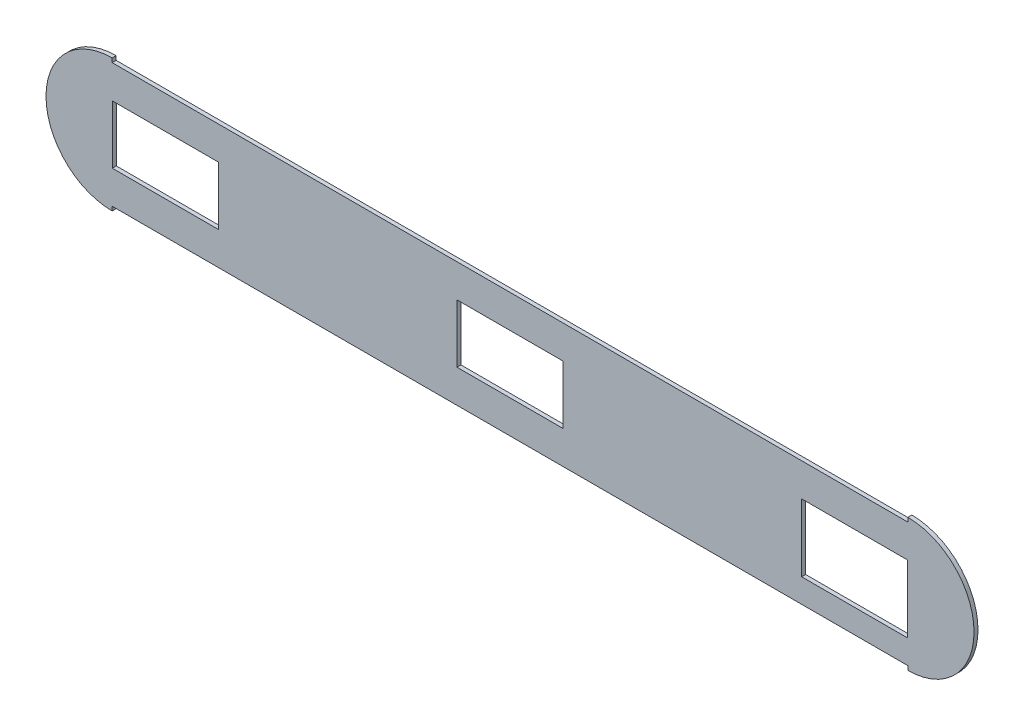
ISO-10303-21;
HEADER;
FILE_DESCRIPTION(('STEP AP214'),'2;1');
FILE_NAME('part.step','',(''),(''),'','','');
FILE_SCHEMA(('AUTOMOTIVE_DESIGN { 1 0 10303 214 1 1 1 1 }'));
ENDSEC;
DATA;
#1=APPLICATION_CONTEXT('core data for automotive mechanical design processes');
#2=APPLICATION_PROTOCOL_DEFINITION('international standard','automotive_design',2000,#1);
#3=PRODUCT_CONTEXT('',#1,'mechanical');
#4=PRODUCT('Part','Part','',(#3));
#5=PRODUCT_RELATED_PRODUCT_CATEGORY('part','',(#4));
#6=PRODUCT_DEFINITION_FORMATION('','',#4);
#7=PRODUCT_DEFINITION_CONTEXT('part definition',#1,'design');
#8=PRODUCT_DEFINITION('design','',#6,#7);
#9=PRODUCT_DEFINITION_SHAPE('','',#8);
#10=(LENGTH_UNIT() NAMED_UNIT(*) SI_UNIT(.MILLI.,.METRE.));
#11=(NAMED_UNIT(*) PLANE_ANGLE_UNIT() SI_UNIT($,.RADIAN.));
#12=(NAMED_UNIT(*) SI_UNIT($,.STERADIAN.) SOLID_ANGLE_UNIT());
#13=UNCERTAINTY_MEASURE_WITH_UNIT(LENGTH_MEASURE(1.E-05),#10,'distance_accuracy_value','');
#14=(GEOMETRIC_REPRESENTATION_CONTEXT(3) GLOBAL_UNCERTAINTY_ASSIGNED_CONTEXT((#13)) GLOBAL_UNIT_ASSIGNED_CONTEXT((#10,
#11,#12)) REPRESENTATION_CONTEXT('',''));
#15=CARTESIAN_POINT('',(0.,0.,0.));
#16=DIRECTION('',(0.,0.,1.));
#17=DIRECTION('',(1.,0.,0.));
#18=AXIS2_PLACEMENT_3D('',#15,#16,#17);
#19=CARTESIAN_POINT('',(-300.,0.,0.));
#20=DIRECTION('',(0.,0.,1.));
#21=DIRECTION('',(1.,0.,0.));
#22=AXIS2_PLACEMENT_3D('',#19,#20,#21);
#23=PLANE('',#22);
#24=DIRECTION('',(1.,0.,0.));
#25=VECTOR('',#24,1.);
#26=CARTESIAN_POINT('',(-300.,-28.9008568911611,0.));
#27=LINE('',#26,#25);
#28=CARTESIAN_POINT('',(220.,-28.900856891161,0.));
#29=VERTEX_POINT('',#28);
#30=CARTESIAN_POINT('',(300.,-28.900856891161,0.));
#31=VERTEX_POINT('',#30);
#32=EDGE_CURVE('E269',#29,#31,#27,.T.);
#33=ORIENTED_EDGE('',*,*,#32,.T.);
#34=DIRECTION('',(0.,1.,0.));
#35=VECTOR('',#34,1.);
#36=CARTESIAN_POINT('',(300.,0.,0.));
#37=LINE('',#36,#35);
#38=CARTESIAN_POINT('',(300.,22.,0.));
#39=VERTEX_POINT('',#38);
#40=EDGE_CURVE('E278',#31,#39,#37,.T.);
#41=ORIENTED_EDGE('',*,*,#40,.T.);
#42=DIRECTION('',(-1.,0.,0.));
#43=VECTOR('',#42,1.);
#44=CARTESIAN_POINT('',(-300.,22.,0.));
#45=LINE('',#44,#43);
#46=CARTESIAN_POINT('',(220.,22.,0.));
#47=VERTEX_POINT('',#46);
#48=EDGE_CURVE('E275',#39,#47,#45,.T.);
#49=ORIENTED_EDGE('',*,*,#48,.T.);
#50=DIRECTION('',(0.,-1.,0.));
#51=VECTOR('',#50,1.);
#52=CARTESIAN_POINT('',(220.,0.,0.));
#53=LINE('',#52,#51);
#54=EDGE_CURVE('E272',#47,#29,#53,.T.);
#55=ORIENTED_EDGE('',*,*,#54,.T.);
#56=EDGE_LOOP('',(#33,#41,#49,#55));
#57=FACE_BOUND('',#56,.T.);
#58=DIRECTION('',(-1.,0.,0.));
#59=VECTOR('',#58,1.);
#60=CARTESIAN_POINT('',(-300.,22.,0.));
#61=LINE('',#60,#59);
#62=CARTESIAN_POINT('',(-220.,22.,0.));
#63=VERTEX_POINT('',#62);
#64=CARTESIAN_POINT('',(-300.,22.,0.));
#65=VERTEX_POINT('',#64);
#66=EDGE_CURVE('E257',#63,#65,#61,.T.);
#67=ORIENTED_EDGE('',*,*,#66,.T.);
#68=DIRECTION('',(0.,-1.,0.));
#69=VECTOR('',#68,1.);
#70=CARTESIAN_POINT('',(-300.,0.,0.));
#71=LINE('',#70,#69);
#72=CARTESIAN_POINT('',(-300.,-22.,0.));
#73=VERTEX_POINT('',#72);
#74=EDGE_CURVE('E266',#65,#73,#71,.T.);
#75=ORIENTED_EDGE('',*,*,#74,.T.);
#76=DIRECTION('',(1.,0.,0.));
#77=VECTOR('',#76,1.);
#78=CARTESIAN_POINT('',(-300.,-22.,0.));
#79=LINE('',#78,#77);
#80=CARTESIAN_POINT('',(-220.,-22.0000000000001,0.));
#81=VERTEX_POINT('',#80);
#82=EDGE_CURVE('E263',#73,#81,#79,.T.);
#83=ORIENTED_EDGE('',*,*,#82,.T.);
#84=DIRECTION('',(0.,1.,0.));
#85=VECTOR('',#84,1.);
#86=CARTESIAN_POINT('',(-220.,0.,0.));
#87=LINE('',#86,#85);
#88=EDGE_CURVE('E260',#81,#63,#87,.T.);
#89=ORIENTED_EDGE('',*,*,#88,.T.);
#90=EDGE_LOOP('',(#67,#75,#83,#89));
#91=FACE_BOUND('',#90,.T.);
#92=DIRECTION('',(1.,0.,0.));
#93=VECTOR('',#92,1.);
#94=CARTESIAN_POINT('',(-300.,-22.,0.));
#95=LINE('',#94,#93);
#96=CARTESIAN_POINT('',(-40.0000000000001,-22.,0.));
#97=VERTEX_POINT('',#96);
#98=CARTESIAN_POINT('',(39.9999999999999,-22.,0.));
#99=VERTEX_POINT('',#98);
#100=EDGE_CURVE('E216',#97,#99,#95,.T.);
#101=ORIENTED_EDGE('',*,*,#100,.T.);
#102=DIRECTION('',(0.,1.,0.));
#103=VECTOR('',#102,1.);
#104=CARTESIAN_POINT('',(39.9999999999999,0.,0.));
#105=LINE('',#104,#103);
#106=CARTESIAN_POINT('',(39.9999999999999,22.,0.));
#107=VERTEX_POINT('',#106);
#108=EDGE_CURVE('E254',#99,#107,#105,.T.);
#109=ORIENTED_EDGE('',*,*,#108,.T.);
#110=DIRECTION('',(-1.,0.,0.));
#111=VECTOR('',#110,1.);
#112=CARTESIAN_POINT('',(-300.,22.,0.));
#113=LINE('',#112,#111);
#114=CARTESIAN_POINT('',(-40.0000000000001,22.,0.));
#115=VERTEX_POINT('',#114);
#116=EDGE_CURVE('E251',#107,#115,#113,.T.);
#117=ORIENTED_EDGE('',*,*,#116,.T.);
#118=DIRECTION('',(0.,-1.,0.));
#119=VECTOR('',#118,1.);
#120=CARTESIAN_POINT('',(-40.0000000000001,0.,0.));
#121=LINE('',#120,#119);
#122=EDGE_CURVE('E248',#115,#97,#121,.T.);
#123=ORIENTED_EDGE('',*,*,#122,.T.);
#124=EDGE_LOOP('',(#101,#109,#117,#123));
#125=FACE_BOUND('',#124,.T.);
#126=CARTESIAN_POINT('',(300.,0.,0.));
#127=DIRECTION('',(0.,0.,1.));
#128=DIRECTION('',(1.,0.,0.));
#129=AXIS2_PLACEMENT_3D('',#126,#127,#128);
#130=CIRCLE('',#129,50.);
#131=CARTESIAN_POINT('',(300.1,-49.9998999999,0.));
#132=VERTEX_POINT('',#131);
#133=CARTESIAN_POINT('',(300.1,49.9998999999,0.));
#134=VERTEX_POINT('',#133);
#135=EDGE_CURVE('E186',#132,#134,#130,.T.);
#136=ORIENTED_EDGE('',*,*,#135,.F.);
#137=DIRECTION('',(0.,-1.,0.));
#138=VECTOR('',#137,1.);
#139=CARTESIAN_POINT('',(300.1,-50.1,0.));
#140=LINE('',#139,#138);
#141=CARTESIAN_POINT('',(300.1,-46.9,0.));
#142=VERTEX_POINT('',#141);
#143=EDGE_CURVE('E46',#142,#132,#140,.T.);
#144=ORIENTED_EDGE('',*,*,#143,.F.);
#145=DIRECTION('',(1.,0.,0.));
#146=VECTOR('',#145,1.);
#147=CARTESIAN_POINT('',(300.1,-46.9,0.));
#148=LINE('',#147,#146);
#149=CARTESIAN_POINT('',(-300.1,-46.9,0.));
#150=VERTEX_POINT('',#149);
#151=EDGE_CURVE('E176',#150,#142,#148,.T.);
#152=ORIENTED_EDGE('',*,*,#151,.F.);
#153=DIRECTION('',(0.,1.,0.));
#154=VECTOR('',#153,1.);
#155=CARTESIAN_POINT('',(-300.1,-50.1,0.));
#156=LINE('',#155,#154);
#157=CARTESIAN_POINT('',(-300.1,-49.9998999999,0.));
#158=VERTEX_POINT('',#157);
#159=EDGE_CURVE('E182',#158,#150,#156,.T.);
#160=ORIENTED_EDGE('',*,*,#159,.F.);
#161=CARTESIAN_POINT('',(-300.,0.,0.));
#162=DIRECTION('',(0.,0.,1.));
#163=DIRECTION('',(1.,0.,0.));
#164=AXIS2_PLACEMENT_3D('',#161,#162,#163);
#165=CIRCLE('',#164,50.);
#166=CARTESIAN_POINT('',(-300.1,49.9998999999,0.));
#167=VERTEX_POINT('',#166);
#168=EDGE_CURVE('E284',#167,#158,#165,.T.);
#169=ORIENTED_EDGE('',*,*,#168,.F.);
#170=DIRECTION('',(0.,-1.,0.));
#171=VECTOR('',#170,1.);
#172=CARTESIAN_POINT('',(-300.1,50.1,0.));
#173=LINE('',#172,#171);
#174=CARTESIAN_POINT('',(-300.1,46.9,0.));
#175=VERTEX_POINT('',#174);
#176=EDGE_CURVE('E194',#167,#175,#173,.T.);
#177=ORIENTED_EDGE('',*,*,#176,.T.);
#178=DIRECTION('',(1.,0.,0.));
#179=VECTOR('',#178,1.);
#180=CARTESIAN_POINT('',(-300.1,46.9,0.));
#181=LINE('',#180,#179);
#182=CARTESIAN_POINT('',(300.1,46.9,0.));
#183=VERTEX_POINT('',#182);
#184=EDGE_CURVE('E197',#175,#183,#181,.T.);
#185=ORIENTED_EDGE('',*,*,#184,.T.);
#186=DIRECTION('',(0.,1.,0.));
#187=VECTOR('',#186,1.);
#188=CARTESIAN_POINT('',(300.1,50.1,0.));
#189=LINE('',#188,#187);
#190=EDGE_CURVE('E200',#183,#134,#189,.T.);
#191=ORIENTED_EDGE('',*,*,#190,.T.);
#192=EDGE_LOOP('',(#136,#144,#152,#160,#169,#177,#185,#191));
#193=FACE_BOUND('',#192,.T.);
#194=ADVANCED_FACE('F32',(#57,#91,#125,#193),#23,.F.);
#195=CARTESIAN_POINT('',(-300.,0.,3.));
#196=DIRECTION('',(0.,0.,1.));
#197=DIRECTION('',(1.,0.,0.));
#198=AXIS2_PLACEMENT_3D('',#195,#196,#197);
#199=PLANE('',#198);
#200=DIRECTION('',(0.,1.,0.));
#201=VECTOR('',#200,1.);
#202=CARTESIAN_POINT('',(300.1,0.,3.));
#203=LINE('',#202,#201);
#204=CARTESIAN_POINT('',(300.1,-49.9998999999,3.));
#205=VERTEX_POINT('',#204);
#206=CARTESIAN_POINT('',(300.1,-46.9,3.));
#207=VERTEX_POINT('',#206);
#208=EDGE_CURVE('E170',#205,#207,#203,.T.);
#209=ORIENTED_EDGE('',*,*,#208,.F.);
#210=CARTESIAN_POINT('',(300.,0.,3.));
#211=DIRECTION('',(0.,0.,1.));
#212=DIRECTION('',(1.,0.,0.));
#213=AXIS2_PLACEMENT_3D('',#210,#211,#212);
#214=CIRCLE('',#213,50.);
#215=CARTESIAN_POINT('',(300.1,49.9998999999,3.));
#216=VERTEX_POINT('',#215);
#217=EDGE_CURVE('E54',#205,#216,#214,.T.);
#218=ORIENTED_EDGE('',*,*,#217,.T.);
#219=DIRECTION('',(0.,1.,0.));
#220=VECTOR('',#219,1.);
#221=CARTESIAN_POINT('',(300.099999999999,-1.04100755793368E-11,3.));
#222=LINE('',#221,#220);
#223=CARTESIAN_POINT('',(300.1,46.9,3.));
#224=VERTEX_POINT('',#223);
#225=EDGE_CURVE('E206',#224,#216,#222,.T.);
#226=ORIENTED_EDGE('',*,*,#225,.F.);
#227=DIRECTION('',(1.,0.,0.));
#228=VECTOR('',#227,1.);
#229=CARTESIAN_POINT('',(-300.,46.9,3.));
#230=LINE('',#229,#228);
#231=CARTESIAN_POINT('',(-300.1,46.9,3.));
#232=VERTEX_POINT('',#231);
#233=EDGE_CURVE('E322',#232,#224,#230,.T.);
#234=ORIENTED_EDGE('',*,*,#233,.F.);
#235=DIRECTION('',(0.,-1.,0.));
#236=VECTOR('',#235,1.);
#237=CARTESIAN_POINT('',(-300.1,0.,3.));
#238=LINE('',#237,#236);
#239=CARTESIAN_POINT('',(-300.1,49.9998999999,3.));
#240=VERTEX_POINT('',#239);
#241=EDGE_CURVE('E210',#240,#232,#238,.T.);
#242=ORIENTED_EDGE('',*,*,#241,.F.);
#243=CARTESIAN_POINT('',(-300.,0.,3.));
#244=DIRECTION('',(0.,0.,1.));
#245=DIRECTION('',(1.,0.,0.));
#246=AXIS2_PLACEMENT_3D('',#243,#244,#245);
#247=CIRCLE('',#246,50.);
#248=CARTESIAN_POINT('',(-300.1,-49.9998999999,3.));
#249=VERTEX_POINT('',#248);
#250=EDGE_CURVE('E283',#240,#249,#247,.T.);
#251=ORIENTED_EDGE('',*,*,#250,.T.);
#252=DIRECTION('',(0.,-1.,0.));
#253=VECTOR('',#252,1.);
#254=CARTESIAN_POINT('',(-300.099999999999,0.,3.));
#255=LINE('',#254,#253);
#256=CARTESIAN_POINT('',(-300.1,-46.9,3.));
#257=VERTEX_POINT('',#256);
#258=EDGE_CURVE('E188',#257,#249,#255,.T.);
#259=ORIENTED_EDGE('',*,*,#258,.F.);
#260=DIRECTION('',(-1.,0.,0.));
#261=VECTOR('',#260,1.);
#262=CARTESIAN_POINT('',(-300.,-46.9,3.));
#263=LINE('',#262,#261);
#264=EDGE_CURVE('E11',#207,#257,#263,.T.);
#265=ORIENTED_EDGE('',*,*,#264,.F.);
#266=EDGE_LOOP('',(#209,#218,#226,#234,#242,#251,#259,#265));
#267=FACE_BOUND('',#266,.T.);
#268=DIRECTION('',(0.,1.,0.));
#269=VECTOR('',#268,1.);
#270=CARTESIAN_POINT('',(300.,0.,3.));
#271=LINE('',#270,#269);
#272=CARTESIAN_POINT('',(300.,-28.900856891161,3.));
#273=VERTEX_POINT('',#272);
#274=CARTESIAN_POINT('',(300.,22.,3.));
#275=VERTEX_POINT('',#274);
#276=EDGE_CURVE('E314',#273,#275,#271,.T.);
#277=ORIENTED_EDGE('',*,*,#276,.F.);
#278=DIRECTION('',(1.,0.,0.));
#279=VECTOR('',#278,1.);
#280=CARTESIAN_POINT('',(-300.,-28.9008568911611,3.));
#281=LINE('',#280,#279);
#282=CARTESIAN_POINT('',(220.,-28.900856891161,3.));
#283=VERTEX_POINT('',#282);
#284=EDGE_CURVE('E307',#283,#273,#281,.T.);
#285=ORIENTED_EDGE('',*,*,#284,.F.);
#286=DIRECTION('',(0.,-1.,0.));
#287=VECTOR('',#286,1.);
#288=CARTESIAN_POINT('',(220.,0.,3.));
#289=LINE('',#288,#287);
#290=CARTESIAN_POINT('',(220.,22.,3.));
#291=VERTEX_POINT('',#290);
#292=EDGE_CURVE('E309',#291,#283,#289,.T.);
#293=ORIENTED_EDGE('',*,*,#292,.F.);
#294=DIRECTION('',(-1.,0.,0.));
#295=VECTOR('',#294,1.);
#296=CARTESIAN_POINT('',(-300.,22.,3.));
#297=LINE('',#296,#295);
#298=EDGE_CURVE('E312',#275,#291,#297,.T.);
#299=ORIENTED_EDGE('',*,*,#298,.F.);
#300=EDGE_LOOP('',(#277,#285,#293,#299));
#301=FACE_BOUND('',#300,.T.);
#302=DIRECTION('',(0.,-1.,0.));
#303=VECTOR('',#302,1.);
#304=CARTESIAN_POINT('',(-300.,0.,3.));
#305=LINE('',#304,#303);
#306=CARTESIAN_POINT('',(-300.,22.,3.));
#307=VERTEX_POINT('',#306);
#308=CARTESIAN_POINT('',(-300.,-22.,3.));
#309=VERTEX_POINT('',#308);
#310=EDGE_CURVE('E305',#307,#309,#305,.T.);
#311=ORIENTED_EDGE('',*,*,#310,.F.);
#312=DIRECTION('',(-1.,0.,0.));
#313=VECTOR('',#312,1.);
#314=CARTESIAN_POINT('',(-300.,22.,3.));
#315=LINE('',#314,#313);
#316=CARTESIAN_POINT('',(-220.,22.,3.));
#317=VERTEX_POINT('',#316);
#318=EDGE_CURVE('E298',#317,#307,#315,.T.);
#319=ORIENTED_EDGE('',*,*,#318,.F.);
#320=DIRECTION('',(0.,1.,0.));
#321=VECTOR('',#320,1.);
#322=CARTESIAN_POINT('',(-220.,0.,3.));
#323=LINE('',#322,#321);
#324=CARTESIAN_POINT('',(-220.,-22.0000000000001,3.));
#325=VERTEX_POINT('',#324);
#326=EDGE_CURVE('E300',#325,#317,#323,.T.);
#327=ORIENTED_EDGE('',*,*,#326,.F.);
#328=DIRECTION('',(1.,0.,0.));
#329=VECTOR('',#328,1.);
#330=CARTESIAN_POINT('',(-300.,-22.,3.));
#331=LINE('',#330,#329);
#332=EDGE_CURVE('E303',#309,#325,#331,.T.);
#333=ORIENTED_EDGE('',*,*,#332,.F.);
#334=EDGE_LOOP('',(#311,#319,#327,#333));
#335=FACE_BOUND('',#334,.T.);
#336=DIRECTION('',(0.,1.,0.));
#337=VECTOR('',#336,1.);
#338=CARTESIAN_POINT('',(39.9999999999999,0.,3.));
#339=LINE('',#338,#337);
#340=CARTESIAN_POINT('',(39.9999999999999,-22.,3.));
#341=VERTEX_POINT('',#340);
#342=CARTESIAN_POINT('',(39.9999999999999,22.,3.));
#343=VERTEX_POINT('',#342);
#344=EDGE_CURVE('E296',#341,#343,#339,.T.);
#345=ORIENTED_EDGE('',*,*,#344,.F.);
#346=DIRECTION('',(1.,0.,0.));
#347=VECTOR('',#346,1.);
#348=CARTESIAN_POINT('',(-300.,-22.,3.));
#349=LINE('',#348,#347);
#350=CARTESIAN_POINT('',(-40.0000000000001,-22.,3.));
#351=VERTEX_POINT('',#350);
#352=EDGE_CURVE('E287',#351,#341,#349,.T.);
#353=ORIENTED_EDGE('',*,*,#352,.F.);
#354=DIRECTION('',(0.,-1.,0.));
#355=VECTOR('',#354,1.);
#356=CARTESIAN_POINT('',(-40.0000000000001,0.,3.));
#357=LINE('',#356,#355);
#358=CARTESIAN_POINT('',(-40.0000000000001,22.,3.));
#359=VERTEX_POINT('',#358);
#360=EDGE_CURVE('E291',#359,#351,#357,.T.);
#361=ORIENTED_EDGE('',*,*,#360,.F.);
#362=DIRECTION('',(-1.,0.,0.));
#363=VECTOR('',#362,1.);
#364=CARTESIAN_POINT('',(-300.,22.,3.));
#365=LINE('',#364,#363);
#366=EDGE_CURVE('E294',#343,#359,#365,.T.);
#367=ORIENTED_EDGE('',*,*,#366,.F.);
#368=EDGE_LOOP('',(#345,#353,#361,#367));
#369=FACE_BOUND('',#368,.T.);
#370=ADVANCED_FACE('F333',(#267,#301,#335,#369),#199,.T.);
#371=CARTESIAN_POINT('',(-300.,0.,60.));
#372=DIRECTION('',(0.,0.,-1.));
#373=DIRECTION('',(-1.,0.,0.));
#374=AXIS2_PLACEMENT_3D('',#371,#372,#373);
#375=CYLINDRICAL_SURFACE('',#374,50.);
#376=ORIENTED_EDGE('',*,*,#168,.T.);
#377=DIRECTION('',(0.,0.,-1.));
#378=VECTOR('',#377,1.);
#379=CARTESIAN_POINT('',(-300.1,-49.9998999999,60.));
#380=LINE('',#379,#378);
#381=EDGE_CURVE('E39',#158,#249,#380,.F.);
#382=ORIENTED_EDGE('',*,*,#381,.T.);
#383=ORIENTED_EDGE('',*,*,#250,.F.);
#384=DIRECTION('',(0.,0.,-1.));
#385=VECTOR('',#384,1.);
#386=CARTESIAN_POINT('',(-300.1,49.9998999999,60.));
#387=LINE('',#386,#385);
#388=EDGE_CURVE('E319',#240,#167,#387,.T.);
#389=ORIENTED_EDGE('',*,*,#388,.T.);
#390=EDGE_LOOP('',(#376,#382,#383,#389));
#391=FACE_BOUND('',#390,.T.);
#392=ADVANCED_FACE('F328',(#391),#375,.T.);
#393=CARTESIAN_POINT('',(300.,0.,60.));
#394=DIRECTION('',(0.,0.,-1.));
#395=DIRECTION('',(-1.,0.,0.));
#396=AXIS2_PLACEMENT_3D('',#393,#394,#395);
#397=CYLINDRICAL_SURFACE('',#396,50.);
#398=ORIENTED_EDGE('',*,*,#217,.F.);
#399=DIRECTION('',(0.,0.,-1.));
#400=VECTOR('',#399,1.);
#401=CARTESIAN_POINT('',(300.1,-49.9998999999,60.));
#402=LINE('',#401,#400);
#403=EDGE_CURVE('E324',#205,#132,#402,.T.);
#404=ORIENTED_EDGE('',*,*,#403,.T.);
#405=ORIENTED_EDGE('',*,*,#135,.T.);
#406=DIRECTION('',(0.,0.,-1.));
#407=VECTOR('',#406,1.);
#408=CARTESIAN_POINT('',(300.1,49.9998999999,60.));
#409=LINE('',#408,#407);
#410=EDGE_CURVE('E316',#134,#216,#409,.F.);
#411=ORIENTED_EDGE('',*,*,#410,.T.);
#412=EDGE_LOOP('',(#398,#404,#405,#411));
#413=FACE_BOUND('',#412,.T.);
#414=ADVANCED_FACE('F380',(#413),#397,.T.);
#415=CARTESIAN_POINT('',(39.9999999999999,22.,60.));
#416=DIRECTION('',(1.,0.,0.));
#417=DIRECTION('',(0.,1.,0.));
#418=AXIS2_PLACEMENT_3D('',#415,#416,#417);
#419=PLANE('',#418);
#420=DIRECTION('',(0.,0.,-1.));
#421=VECTOR('',#420,1.);
#422=CARTESIAN_POINT('',(39.9999999999999,-22.,60.));
#423=LINE('',#422,#421);
#424=EDGE_CURVE('E212',#341,#99,#423,.T.);
#425=ORIENTED_EDGE('',*,*,#424,.F.);
#426=ORIENTED_EDGE('',*,*,#344,.T.);
#427=DIRECTION('',(0.,0.,-1.));
#428=VECTOR('',#427,1.);
#429=CARTESIAN_POINT('',(39.9999999999999,22.,60.));
#430=LINE('',#429,#428);
#431=EDGE_CURVE('E236',#343,#107,#430,.T.);
#432=ORIENTED_EDGE('',*,*,#431,.T.);
#433=ORIENTED_EDGE('',*,*,#108,.F.);
#434=EDGE_LOOP('',(#425,#426,#432,#433));
#435=FACE_BOUND('',#434,.T.);
#436=ADVANCED_FACE('F369',(#435),#419,.F.);
#437=CARTESIAN_POINT('',(39.9999999999999,22.,60.));
#438=DIRECTION('',(0.,1.,0.));
#439=DIRECTION('',(0.,0.,1.));
#440=AXIS2_PLACEMENT_3D('',#437,#438,#439);
#441=PLANE('',#440);
#442=ORIENTED_EDGE('',*,*,#431,.F.);
#443=ORIENTED_EDGE('',*,*,#366,.T.);
#444=DIRECTION('',(0.,0.,-1.));
#445=VECTOR('',#444,1.);
#446=CARTESIAN_POINT('',(-40.0000000000001,22.,60.));
#447=LINE('',#446,#445);
#448=EDGE_CURVE('E239',#359,#115,#447,.T.);
#449=ORIENTED_EDGE('',*,*,#448,.T.);
#450=ORIENTED_EDGE('',*,*,#116,.F.);
#451=EDGE_LOOP('',(#442,#443,#449,#450));
#452=FACE_BOUND('',#451,.T.);
#453=ADVANCED_FACE('F372',(#452),#441,.F.);
#454=CARTESIAN_POINT('',(-40.0000000000001,22.,60.));
#455=DIRECTION('',(-1.,0.,0.));
#456=DIRECTION('',(0.,-1.,0.));
#457=AXIS2_PLACEMENT_3D('',#454,#455,#456);
#458=PLANE('',#457);
#459=ORIENTED_EDGE('',*,*,#448,.F.);
#460=ORIENTED_EDGE('',*,*,#360,.T.);
#461=DIRECTION('',(0.,0.,-1.));
#462=VECTOR('',#461,1.);
#463=CARTESIAN_POINT('',(-40.0000000000001,-22.,60.));
#464=LINE('',#463,#462);
#465=EDGE_CURVE('E242',#351,#97,#464,.T.);
#466=ORIENTED_EDGE('',*,*,#465,.T.);
#467=ORIENTED_EDGE('',*,*,#122,.F.);
#468=EDGE_LOOP('',(#459,#460,#466,#467));
#469=FACE_BOUND('',#468,.T.);
#470=ADVANCED_FACE('F362',(#469),#458,.F.);
#471=CARTESIAN_POINT('',(39.9999999999999,-22.,60.));
#472=DIRECTION('',(0.,-1.,0.));
#473=DIRECTION('',(0.,0.,-1.));
#474=AXIS2_PLACEMENT_3D('',#471,#472,#473);
#475=PLANE('',#474);
#476=ORIENTED_EDGE('',*,*,#465,.F.);
#477=ORIENTED_EDGE('',*,*,#352,.T.);
#478=ORIENTED_EDGE('',*,*,#424,.T.);
#479=ORIENTED_EDGE('',*,*,#100,.F.);
#480=EDGE_LOOP('',(#476,#477,#478,#479));
#481=FACE_BOUND('',#480,.T.);
#482=ADVANCED_FACE('F358',(#481),#475,.F.);
#483=CARTESIAN_POINT('',(-300.,-22.,60.));
#484=DIRECTION('',(-1.,0.,0.));
#485=DIRECTION('',(0.,0.,1.));
#486=AXIS2_PLACEMENT_3D('',#483,#484,#485);
#487=PLANE('',#486);
#488=DIRECTION('',(0.,0.,-1.));
#489=VECTOR('',#488,1.);
#490=CARTESIAN_POINT('',(-300.,22.,60.));
#491=LINE('',#490,#489);
#492=EDGE_CURVE('E234',#307,#65,#491,.T.);
#493=ORIENTED_EDGE('',*,*,#492,.F.);
#494=ORIENTED_EDGE('',*,*,#310,.T.);
#495=DIRECTION('',(0.,0.,-1.));
#496=VECTOR('',#495,1.);
#497=CARTESIAN_POINT('',(-300.,-22.,60.));
#498=LINE('',#497,#496);
#499=EDGE_CURVE('E225',#309,#73,#498,.T.);
#500=ORIENTED_EDGE('',*,*,#499,.T.);
#501=ORIENTED_EDGE('',*,*,#74,.F.);
#502=EDGE_LOOP('',(#493,#494,#500,#501));
#503=FACE_BOUND('',#502,.T.);
#504=ADVANCED_FACE('F383',(#503),#487,.F.);
#505=CARTESIAN_POINT('',(-300.,-22.,60.));
#506=DIRECTION('',(0.,-1.,0.));
#507=DIRECTION('',(1.,0.,0.));
#508=AXIS2_PLACEMENT_3D('',#505,#506,#507);
#509=PLANE('',#508);
#510=ORIENTED_EDGE('',*,*,#499,.F.);
#511=ORIENTED_EDGE('',*,*,#332,.T.);
#512=DIRECTION('',(0.,0.,-1.));
#513=VECTOR('',#512,1.);
#514=CARTESIAN_POINT('',(-220.,-22.0000000000001,60.));
#515=LINE('',#514,#513);
#516=EDGE_CURVE('E228',#325,#81,#515,.T.);
#517=ORIENTED_EDGE('',*,*,#516,.T.);
#518=ORIENTED_EDGE('',*,*,#82,.F.);
#519=EDGE_LOOP('',(#510,#511,#517,#518));
#520=FACE_BOUND('',#519,.T.);
#521=ADVANCED_FACE('F433',(#520),#509,.F.);
#522=CARTESIAN_POINT('',(-220.,-22.0000000000001,60.));
#523=DIRECTION('',(1.,0.,0.));
#524=DIRECTION('',(0.,0.,-1.));
#525=AXIS2_PLACEMENT_3D('',#522,#523,#524);
#526=PLANE('',#525);
#527=ORIENTED_EDGE('',*,*,#516,.F.);
#528=ORIENTED_EDGE('',*,*,#326,.T.);
#529=DIRECTION('',(0.,0.,-1.));
#530=VECTOR('',#529,1.);
#531=CARTESIAN_POINT('',(-220.,22.,60.));
#532=LINE('',#531,#530);
#533=EDGE_CURVE('E231',#317,#63,#532,.T.);
#534=ORIENTED_EDGE('',*,*,#533,.T.);
#535=ORIENTED_EDGE('',*,*,#88,.F.);
#536=EDGE_LOOP('',(#527,#528,#534,#535));
#537=FACE_BOUND('',#536,.T.);
#538=ADVANCED_FACE('F442',(#537),#526,.F.);
#539=CARTESIAN_POINT('',(-300.,22.,60.));
#540=DIRECTION('',(0.,1.,0.));
#541=DIRECTION('',(-1.,0.,0.));
#542=AXIS2_PLACEMENT_3D('',#539,#540,#541);
#543=PLANE('',#542);
#544=ORIENTED_EDGE('',*,*,#533,.F.);
#545=ORIENTED_EDGE('',*,*,#318,.T.);
#546=ORIENTED_EDGE('',*,*,#492,.T.);
#547=ORIENTED_EDGE('',*,*,#66,.F.);
#548=EDGE_LOOP('',(#544,#545,#546,#547));
#549=FACE_BOUND('',#548,.T.);
#550=ADVANCED_FACE('F452',(#549),#543,.F.);
#551=CARTESIAN_POINT('',(300.,-28.900856891161,60.));
#552=DIRECTION('',(1.,0.,0.));
#553=DIRECTION('',(0.,0.,-1.));
#554=AXIS2_PLACEMENT_3D('',#551,#552,#553);
#555=PLANE('',#554);
#556=DIRECTION('',(0.,0.,-1.));
#557=VECTOR('',#556,1.);
#558=CARTESIAN_POINT('',(300.,-28.900856891161,60.));
#559=LINE('',#558,#557);
#560=EDGE_CURVE('E223',#273,#31,#559,.T.);
#561=ORIENTED_EDGE('',*,*,#560,.F.);
#562=ORIENTED_EDGE('',*,*,#276,.T.);
#563=DIRECTION('',(0.,0.,-1.));
#564=VECTOR('',#563,1.);
#565=CARTESIAN_POINT('',(300.,22.,60.));
#566=LINE('',#565,#564);
#567=EDGE_CURVE('E213',#275,#39,#566,.T.);
#568=ORIENTED_EDGE('',*,*,#567,.T.);
#569=ORIENTED_EDGE('',*,*,#40,.F.);
#570=EDGE_LOOP('',(#561,#562,#568,#569));
#571=FACE_BOUND('',#570,.T.);
#572=ADVANCED_FACE('F462',(#571),#555,.F.);
#573=CARTESIAN_POINT('',(300.,22.,60.));
#574=DIRECTION('',(0.,1.,0.));
#575=DIRECTION('',(0.,0.,1.));
#576=AXIS2_PLACEMENT_3D('',#573,#574,#575);
#577=PLANE('',#576);
#578=ORIENTED_EDGE('',*,*,#567,.F.);
#579=ORIENTED_EDGE('',*,*,#298,.T.);
#580=DIRECTION('',(0.,0.,-1.));
#581=VECTOR('',#580,1.);
#582=CARTESIAN_POINT('',(220.,22.,60.));
#583=LINE('',#582,#581);
#584=EDGE_CURVE('E217',#291,#47,#583,.T.);
#585=ORIENTED_EDGE('',*,*,#584,.T.);
#586=ORIENTED_EDGE('',*,*,#48,.F.);
#587=EDGE_LOOP('',(#578,#579,#585,#586));
#588=FACE_BOUND('',#587,.T.);
#589=ADVANCED_FACE('F471',(#588),#577,.F.);
#590=CARTESIAN_POINT('',(220.,-28.900856891161,60.));
#591=DIRECTION('',(-1.,0.,0.));
#592=DIRECTION('',(0.,0.,1.));
#593=AXIS2_PLACEMENT_3D('',#590,#591,#592);
#594=PLANE('',#593);
#595=ORIENTED_EDGE('',*,*,#584,.F.);
#596=ORIENTED_EDGE('',*,*,#292,.T.);
#597=DIRECTION('',(0.,0.,-1.));
#598=VECTOR('',#597,1.);
#599=CARTESIAN_POINT('',(220.,-28.900856891161,60.));
#600=LINE('',#599,#598);
#601=EDGE_CURVE('E220',#283,#29,#600,.T.);
#602=ORIENTED_EDGE('',*,*,#601,.T.);
#603=ORIENTED_EDGE('',*,*,#54,.F.);
#604=EDGE_LOOP('',(#595,#596,#602,#603));
#605=FACE_BOUND('',#604,.T.);
#606=ADVANCED_FACE('F481',(#605),#594,.F.);
#607=CARTESIAN_POINT('',(300.,-28.900856891161,60.));
#608=DIRECTION('',(0.,-1.,0.));
#609=DIRECTION('',(1.,0.,0.));
#610=AXIS2_PLACEMENT_3D('',#607,#608,#609);
#611=PLANE('',#610);
#612=ORIENTED_EDGE('',*,*,#601,.F.);
#613=ORIENTED_EDGE('',*,*,#284,.T.);
#614=ORIENTED_EDGE('',*,*,#560,.T.);
#615=ORIENTED_EDGE('',*,*,#32,.F.);
#616=EDGE_LOOP('',(#612,#613,#614,#615));
#617=FACE_BOUND('',#616,.T.);
#618=ADVANCED_FACE('F491',(#617),#611,.F.);
#619=CARTESIAN_POINT('',(300.1,50.1,0.));
#620=DIRECTION('',(1.,0.,0.));
#621=DIRECTION('',(0.,1.,0.));
#622=AXIS2_PLACEMENT_3D('',#619,#620,#621);
#623=PLANE('',#622);
#624=ORIENTED_EDGE('',*,*,#225,.T.);
#625=ORIENTED_EDGE('',*,*,#410,.F.);
#626=ORIENTED_EDGE('',*,*,#190,.F.);
#627=DIRECTION('',(0.,0.,1.));
#628=VECTOR('',#627,1.);
#629=CARTESIAN_POINT('',(300.1,46.9,0.));
#630=LINE('',#629,#628);
#631=EDGE_CURVE('E203',#183,#224,#630,.T.);
#632=ORIENTED_EDGE('',*,*,#631,.T.);
#633=EDGE_LOOP('',(#624,#625,#626,#632));
#634=FACE_BOUND('',#633,.T.);
#635=ADVANCED_FACE('F501',(#634),#623,.F.);
#636=CARTESIAN_POINT('',(-300.1,46.9,0.));
#637=DIRECTION('',(0.,-1.,0.));
#638=DIRECTION('',(0.,0.,-1.));
#639=AXIS2_PLACEMENT_3D('',#636,#637,#638);
#640=PLANE('',#639);
#641=ORIENTED_EDGE('',*,*,#233,.T.);
#642=ORIENTED_EDGE('',*,*,#631,.F.);
#643=ORIENTED_EDGE('',*,*,#184,.F.);
#644=DIRECTION('',(0.,0.,1.));
#645=VECTOR('',#644,1.);
#646=CARTESIAN_POINT('',(-300.1,46.9,0.));
#647=LINE('',#646,#645);
#648=EDGE_CURVE('E202',#175,#232,#647,.T.);
#649=ORIENTED_EDGE('',*,*,#648,.T.);
#650=EDGE_LOOP('',(#641,#642,#643,#649));
#651=FACE_BOUND('',#650,.T.);
#652=ADVANCED_FACE('F340',(#651),#640,.F.);
#653=CARTESIAN_POINT('',(-300.1,50.1,0.));
#654=DIRECTION('',(-1.,0.,0.));
#655=DIRECTION('',(0.,0.,1.));
#656=AXIS2_PLACEMENT_3D('',#653,#654,#655);
#657=PLANE('',#656);
#658=ORIENTED_EDGE('',*,*,#241,.T.);
#659=ORIENTED_EDGE('',*,*,#648,.F.);
#660=ORIENTED_EDGE('',*,*,#176,.F.);
#661=ORIENTED_EDGE('',*,*,#388,.F.);
#662=EDGE_LOOP('',(#658,#659,#660,#661));
#663=FACE_BOUND('',#662,.T.);
#664=ADVANCED_FACE('F337',(#663),#657,.F.);
#665=CARTESIAN_POINT('',(300.1,-50.1,60.001));
#666=DIRECTION('',(1.,0.,0.));
#667=DIRECTION('',(0.,0.,-1.));
#668=AXIS2_PLACEMENT_3D('',#665,#666,#667);
#669=PLANE('',#668);
#670=ORIENTED_EDGE('',*,*,#208,.T.);
#671=DIRECTION('',(0.,0.,-1.));
#672=VECTOR('',#671,1.);
#673=CARTESIAN_POINT('',(300.1,-46.9,60.001));
#674=LINE('',#673,#672);
#675=EDGE_CURVE('E167',#207,#142,#674,.T.);
#676=ORIENTED_EDGE('',*,*,#675,.T.);
#677=ORIENTED_EDGE('',*,*,#143,.T.);
#678=ORIENTED_EDGE('',*,*,#403,.F.);
#679=EDGE_LOOP('',(#670,#676,#677,#678));
#680=FACE_BOUND('',#679,.T.);
#681=ADVANCED_FACE('F169',(#680),#669,.F.);
#682=CARTESIAN_POINT('',(300.1,-46.9,60.001));
#683=DIRECTION('',(0.,1.,0.));
#684=DIRECTION('',(0.,0.,1.));
#685=AXIS2_PLACEMENT_3D('',#682,#683,#684);
#686=PLANE('',#685);
#687=ORIENTED_EDGE('',*,*,#264,.T.);
#688=DIRECTION('',(0.,0.,-1.));
#689=VECTOR('',#688,1.);
#690=CARTESIAN_POINT('',(-300.1,-46.9,60.001));
#691=LINE('',#690,#689);
#692=EDGE_CURVE('E173',#257,#150,#691,.T.);
#693=ORIENTED_EDGE('',*,*,#692,.T.);
#694=ORIENTED_EDGE('',*,*,#151,.T.);
#695=ORIENTED_EDGE('',*,*,#675,.F.);
#696=EDGE_LOOP('',(#687,#693,#694,#695));
#697=FACE_BOUND('',#696,.T.);
#698=ADVANCED_FACE('F177',(#697),#686,.F.);
#699=CARTESIAN_POINT('',(-300.1,-50.1,60.001));
#700=DIRECTION('',(-1.,0.,0.));
#701=DIRECTION('',(0.,-1.,0.));
#702=AXIS2_PLACEMENT_3D('',#699,#700,#701);
#703=PLANE('',#702);
#704=ORIENTED_EDGE('',*,*,#258,.T.);
#705=ORIENTED_EDGE('',*,*,#381,.F.);
#706=ORIENTED_EDGE('',*,*,#159,.T.);
#707=ORIENTED_EDGE('',*,*,#692,.F.);
#708=EDGE_LOOP('',(#704,#705,#706,#707));
#709=FACE_BOUND('',#708,.T.);
#710=ADVANCED_FACE('F342',(#709),#703,.F.);
#711=CLOSED_SHELL('',(#194,#370,#392,#414,#436,#453,#470,#482,#504,#521,#538,#550,#572,#589,
#606,#618,#635,#652,#664,#681,#698,#710));
#712=MANIFOLD_SOLID_BREP('B2',#711);
#713=ADVANCED_BREP_SHAPE_REPRESENTATION('',(#18,#712),#14);
#714=SHAPE_DEFINITION_REPRESENTATION(#9,#713);
ENDSEC;
END-ISO-10303-21;
